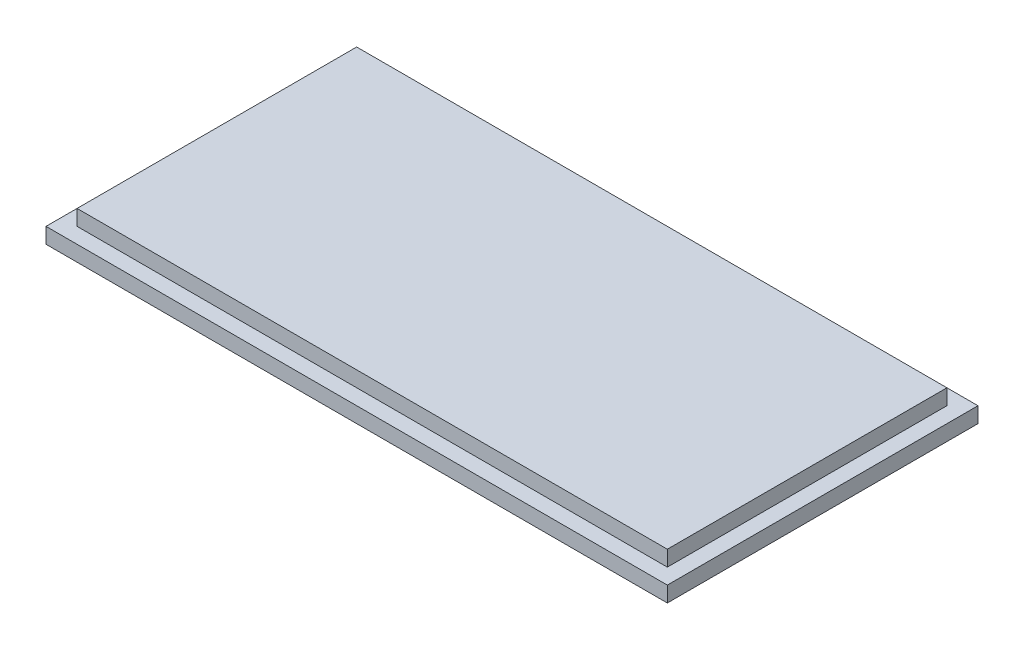
ISO-10303-21;
HEADER;
FILE_DESCRIPTION(('STEP AP214'),'2;1');
FILE_NAME('part.step','',(''),(''),'','','');
FILE_SCHEMA(('AUTOMOTIVE_DESIGN { 1 0 10303 214 1 1 1 1 }'));
ENDSEC;
DATA;
#1=APPLICATION_CONTEXT('core data for automotive mechanical design processes');
#2=APPLICATION_PROTOCOL_DEFINITION('international standard','automotive_design',2000,#1);
#3=PRODUCT_CONTEXT('',#1,'mechanical');
#4=PRODUCT('Part','Part','',(#3));
#5=PRODUCT_RELATED_PRODUCT_CATEGORY('part','',(#4));
#6=PRODUCT_DEFINITION_FORMATION('','',#4);
#7=PRODUCT_DEFINITION_CONTEXT('part definition',#1,'design');
#8=PRODUCT_DEFINITION('design','',#6,#7);
#9=PRODUCT_DEFINITION_SHAPE('','',#8);
#10=(LENGTH_UNIT() NAMED_UNIT(*) SI_UNIT(.MILLI.,.METRE.));
#11=(NAMED_UNIT(*) PLANE_ANGLE_UNIT() SI_UNIT($,.RADIAN.));
#12=(NAMED_UNIT(*) SI_UNIT($,.STERADIAN.) SOLID_ANGLE_UNIT());
#13=UNCERTAINTY_MEASURE_WITH_UNIT(LENGTH_MEASURE(1.E-05),#10,'distance_accuracy_value','');
#14=(GEOMETRIC_REPRESENTATION_CONTEXT(3) GLOBAL_UNCERTAINTY_ASSIGNED_CONTEXT((#13)) GLOBAL_UNIT_ASSIGNED_CONTEXT((#10,
#11,#12)) REPRESENTATION_CONTEXT('',''));
#15=CARTESIAN_POINT('',(0.,0.,0.));
#16=DIRECTION('',(0.,0.,1.));
#17=DIRECTION('',(1.,0.,0.));
#18=AXIS2_PLACEMENT_3D('',#15,#16,#17);
#19=CARTESIAN_POINT('',(0.,5.,0.));
#20=DIRECTION('',(0.,-1.,0.));
#21=DIRECTION('',(0.,0.,-1.));
#22=AXIS2_PLACEMENT_3D('',#19,#20,#21);
#23=PLANE('',#22);
#24=DIRECTION('',(0.,0.,1.));
#25=VECTOR('',#24,1.);
#26=CARTESIAN_POINT('',(0.,5.,0.));
#27=LINE('',#26,#25);
#28=CARTESIAN_POINT('',(0.,5.,-100.));
#29=VERTEX_POINT('',#28);
#30=CARTESIAN_POINT('',(0.,5.,0.));
#31=VERTEX_POINT('',#30);
#32=EDGE_CURVE('E139',#29,#31,#27,.T.);
#33=ORIENTED_EDGE('',*,*,#32,.T.);
#34=DIRECTION('',(1.,0.,0.));
#35=VECTOR('',#34,1.);
#36=CARTESIAN_POINT('',(0.,5.,0.));
#37=LINE('',#36,#35);
#38=CARTESIAN_POINT('',(200.,5.,0.));
#39=VERTEX_POINT('',#38);
#40=EDGE_CURVE('E143',#31,#39,#37,.T.);
#41=ORIENTED_EDGE('',*,*,#40,.T.);
#42=DIRECTION('',(0.,0.,-1.));
#43=VECTOR('',#42,1.);
#44=CARTESIAN_POINT('',(200.,5.,0.));
#45=LINE('',#44,#43);
#46=CARTESIAN_POINT('',(200.,5.,-100.));
#47=VERTEX_POINT('',#46);
#48=EDGE_CURVE('E147',#39,#47,#45,.T.);
#49=ORIENTED_EDGE('',*,*,#48,.T.);
#50=DIRECTION('',(-1.,0.,0.));
#51=VECTOR('',#50,1.);
#52=CARTESIAN_POINT('',(0.,5.,-100.));
#53=LINE('',#52,#51);
#54=EDGE_CURVE('E150',#47,#29,#53,.T.);
#55=ORIENTED_EDGE('',*,*,#54,.T.);
#56=EDGE_LOOP('',(#33,#41,#49,#55));
#57=FACE_BOUND('',#56,.T.);
#58=DIRECTION('',(0.,0.,-1.));
#59=VECTOR('',#58,1.);
#60=CARTESIAN_POINT('',(195.,5.,-95.));
#61=LINE('',#60,#59);
#62=CARTESIAN_POINT('',(195.,5.,-5.));
#63=VERTEX_POINT('',#62);
#64=CARTESIAN_POINT('',(195.,5.,-95.));
#65=VERTEX_POINT('',#64);
#66=EDGE_CURVE('E55',#63,#65,#61,.T.);
#67=ORIENTED_EDGE('',*,*,#66,.F.);
#68=DIRECTION('',(1.,0.,0.));
#69=VECTOR('',#68,1.);
#70=CARTESIAN_POINT('',(4.99999999999994,5.,-5.));
#71=LINE('',#70,#69);
#72=CARTESIAN_POINT('',(4.99999999999994,5.,-5.));
#73=VERTEX_POINT('',#72);
#74=EDGE_CURVE('E59',#73,#63,#71,.T.);
#75=ORIENTED_EDGE('',*,*,#74,.F.);
#76=DIRECTION('',(0.,0.,1.));
#77=VECTOR('',#76,1.);
#78=CARTESIAN_POINT('',(4.99999999999994,5.,-95.));
#79=LINE('',#78,#77);
#80=CARTESIAN_POINT('',(4.99999999999994,5.,-95.));
#81=VERTEX_POINT('',#80);
#82=EDGE_CURVE('E283',#81,#73,#79,.T.);
#83=ORIENTED_EDGE('',*,*,#82,.F.);
#84=DIRECTION('',(-1.,0.,0.));
#85=VECTOR('',#84,1.);
#86=CARTESIAN_POINT('',(4.99999999999994,5.,-95.));
#87=LINE('',#86,#85);
#88=EDGE_CURVE('E293',#65,#81,#87,.T.);
#89=ORIENTED_EDGE('',*,*,#88,.F.);
#90=EDGE_LOOP('',(#67,#75,#83,#89));
#91=FACE_BOUND('',#90,.T.);
#92=ADVANCED_FACE('F39',(#57,#91),#23,.F.);
#93=CARTESIAN_POINT('',(0.,5.,0.));
#94=DIRECTION('',(1.,0.,0.));
#95=DIRECTION('',(0.,0.,-1.));
#96=AXIS2_PLACEMENT_3D('',#93,#94,#95);
#97=PLANE('',#96);
#98=DIRECTION('',(0.,0.,1.));
#99=VECTOR('',#98,1.);
#100=CARTESIAN_POINT('',(0.,0.,0.));
#101=LINE('',#100,#99);
#102=CARTESIAN_POINT('',(0.,0.,-100.));
#103=VERTEX_POINT('',#102);
#104=CARTESIAN_POINT('',(0.,0.,0.));
#105=VERTEX_POINT('',#104);
#106=EDGE_CURVE('E128',#103,#105,#101,.T.);
#107=ORIENTED_EDGE('',*,*,#106,.T.);
#108=DIRECTION('',(0.,-1.,0.));
#109=VECTOR('',#108,1.);
#110=CARTESIAN_POINT('',(0.,5.,0.));
#111=LINE('',#110,#109);
#112=EDGE_CURVE('E11',#31,#105,#111,.T.);
#113=ORIENTED_EDGE('',*,*,#112,.F.);
#114=ORIENTED_EDGE('',*,*,#32,.F.);
#115=DIRECTION('',(0.,-1.,0.));
#116=VECTOR('',#115,1.);
#117=CARTESIAN_POINT('',(0.,5.,-100.));
#118=LINE('',#117,#116);
#119=EDGE_CURVE('E152',#29,#103,#118,.T.);
#120=ORIENTED_EDGE('',*,*,#119,.T.);
#121=EDGE_LOOP('',(#107,#113,#114,#120));
#122=FACE_BOUND('',#121,.T.);
#123=ADVANCED_FACE('F41',(#122),#97,.F.);
#124=CARTESIAN_POINT('',(0.,5.,0.));
#125=DIRECTION('',(0.,0.,-1.));
#126=DIRECTION('',(-1.,0.,0.));
#127=AXIS2_PLACEMENT_3D('',#124,#125,#126);
#128=PLANE('',#127);
#129=DIRECTION('',(1.,0.,0.));
#130=VECTOR('',#129,1.);
#131=CARTESIAN_POINT('',(0.,0.,0.));
#132=LINE('',#131,#130);
#133=CARTESIAN_POINT('',(200.,0.,0.));
#134=VERTEX_POINT('',#133);
#135=EDGE_CURVE('E133',#105,#134,#132,.T.);
#136=ORIENTED_EDGE('',*,*,#135,.T.);
#137=DIRECTION('',(0.,-1.,0.));
#138=VECTOR('',#137,1.);
#139=CARTESIAN_POINT('',(200.,5.,0.));
#140=LINE('',#139,#138);
#141=EDGE_CURVE('E48',#39,#134,#140,.T.);
#142=ORIENTED_EDGE('',*,*,#141,.F.);
#143=ORIENTED_EDGE('',*,*,#40,.F.);
#144=ORIENTED_EDGE('',*,*,#112,.T.);
#145=EDGE_LOOP('',(#136,#142,#143,#144));
#146=FACE_BOUND('',#145,.T.);
#147=ADVANCED_FACE('F188',(#146),#128,.F.);
#148=CARTESIAN_POINT('',(200.,5.,0.));
#149=DIRECTION('',(-1.,0.,0.));
#150=DIRECTION('',(0.,0.,1.));
#151=AXIS2_PLACEMENT_3D('',#148,#149,#150);
#152=PLANE('',#151);
#153=DIRECTION('',(0.,0.,-1.));
#154=VECTOR('',#153,1.);
#155=CARTESIAN_POINT('',(200.,0.,0.));
#156=LINE('',#155,#154);
#157=CARTESIAN_POINT('',(200.,0.,-100.));
#158=VERTEX_POINT('',#157);
#159=EDGE_CURVE('E156',#134,#158,#156,.T.);
#160=ORIENTED_EDGE('',*,*,#159,.T.);
#161=DIRECTION('',(0.,-1.,0.));
#162=VECTOR('',#161,1.);
#163=CARTESIAN_POINT('',(200.,5.,-100.));
#164=LINE('',#163,#162);
#165=EDGE_CURVE('E164',#47,#158,#164,.T.);
#166=ORIENTED_EDGE('',*,*,#165,.F.);
#167=ORIENTED_EDGE('',*,*,#48,.F.);
#168=ORIENTED_EDGE('',*,*,#141,.T.);
#169=EDGE_LOOP('',(#160,#166,#167,#168));
#170=FACE_BOUND('',#169,.T.);
#171=ADVANCED_FACE('F173',(#170),#152,.F.);
#172=CARTESIAN_POINT('',(0.,5.,-100.));
#173=DIRECTION('',(0.,0.,1.));
#174=DIRECTION('',(1.,0.,0.));
#175=AXIS2_PLACEMENT_3D('',#172,#173,#174);
#176=PLANE('',#175);
#177=DIRECTION('',(-1.,0.,0.));
#178=VECTOR('',#177,1.);
#179=CARTESIAN_POINT('',(0.,0.,-100.));
#180=LINE('',#179,#178);
#181=EDGE_CURVE('E144',#158,#103,#180,.T.);
#182=ORIENTED_EDGE('',*,*,#181,.T.);
#183=ORIENTED_EDGE('',*,*,#119,.F.);
#184=ORIENTED_EDGE('',*,*,#54,.F.);
#185=ORIENTED_EDGE('',*,*,#165,.T.);
#186=EDGE_LOOP('',(#182,#183,#184,#185));
#187=FACE_BOUND('',#186,.T.);
#188=ADVANCED_FACE('F182',(#187),#176,.F.);
#189=CARTESIAN_POINT('',(0.,0.,0.));
#190=DIRECTION('',(0.,-1.,0.));
#191=DIRECTION('',(0.,0.,-1.));
#192=AXIS2_PLACEMENT_3D('',#189,#190,#191);
#193=PLANE('',#192);
#194=ORIENTED_EDGE('',*,*,#106,.F.);
#195=ORIENTED_EDGE('',*,*,#181,.F.);
#196=ORIENTED_EDGE('',*,*,#159,.F.);
#197=ORIENTED_EDGE('',*,*,#135,.F.);
#198=EDGE_LOOP('',(#194,#195,#196,#197));
#199=FACE_BOUND('',#198,.T.);
#200=ADVANCED_FACE('F179',(#199),#193,.T.);
#201=CARTESIAN_POINT('',(195.,10.,-95.));
#202=DIRECTION('',(-1.,0.,0.));
#203=DIRECTION('',(0.,0.,1.));
#204=AXIS2_PLACEMENT_3D('',#201,#202,#203);
#205=PLANE('',#204);
#206=ORIENTED_EDGE('',*,*,#66,.T.);
#207=DIRECTION('',(0.,-1.,0.));
#208=VECTOR('',#207,1.);
#209=CARTESIAN_POINT('',(195.,10.,-95.));
#210=LINE('',#209,#208);
#211=CARTESIAN_POINT('',(195.,10.,-95.));
#212=VERTEX_POINT('',#211);
#213=EDGE_CURVE('E108',#212,#65,#210,.T.);
#214=ORIENTED_EDGE('',*,*,#213,.F.);
#215=DIRECTION('',(0.,0.,-1.));
#216=VECTOR('',#215,1.);
#217=CARTESIAN_POINT('',(195.,10.,-95.));
#218=LINE('',#217,#216);
#219=CARTESIAN_POINT('',(195.,10.,-5.));
#220=VERTEX_POINT('',#219);
#221=EDGE_CURVE('E115',#220,#212,#218,.T.);
#222=ORIENTED_EDGE('',*,*,#221,.F.);
#223=DIRECTION('',(0.,-1.,0.));
#224=VECTOR('',#223,1.);
#225=CARTESIAN_POINT('',(195.,10.,-5.));
#226=LINE('',#225,#224);
#227=EDGE_CURVE('E280',#220,#63,#226,.T.);
#228=ORIENTED_EDGE('',*,*,#227,.T.);
#229=EDGE_LOOP('',(#206,#214,#222,#228));
#230=FACE_BOUND('',#229,.T.);
#231=ADVANCED_FACE('F126',(#230),#205,.F.);
#232=CARTESIAN_POINT('',(4.99999999999994,10.,-95.));
#233=DIRECTION('',(0.,0.,1.));
#234=DIRECTION('',(1.,0.,0.));
#235=AXIS2_PLACEMENT_3D('',#232,#233,#234);
#236=PLANE('',#235);
#237=ORIENTED_EDGE('',*,*,#88,.T.);
#238=DIRECTION('',(0.,-1.,0.));
#239=VECTOR('',#238,1.);
#240=CARTESIAN_POINT('',(4.99999999999994,10.,-95.));
#241=LINE('',#240,#239);
#242=CARTESIAN_POINT('',(4.99999999999994,10.,-95.));
#243=VERTEX_POINT('',#242);
#244=EDGE_CURVE('E110',#243,#81,#241,.T.);
#245=ORIENTED_EDGE('',*,*,#244,.F.);
#246=DIRECTION('',(-1.,0.,0.));
#247=VECTOR('',#246,1.);
#248=CARTESIAN_POINT('',(4.99999999999994,10.,-95.));
#249=LINE('',#248,#247);
#250=EDGE_CURVE('E103',#212,#243,#249,.T.);
#251=ORIENTED_EDGE('',*,*,#250,.F.);
#252=ORIENTED_EDGE('',*,*,#213,.T.);
#253=EDGE_LOOP('',(#237,#245,#251,#252));
#254=FACE_BOUND('',#253,.T.);
#255=ADVANCED_FACE('F106',(#254),#236,.F.);
#256=CARTESIAN_POINT('',(4.99999999999994,10.,-95.));
#257=DIRECTION('',(1.,0.,0.));
#258=DIRECTION('',(0.,0.,-1.));
#259=AXIS2_PLACEMENT_3D('',#256,#257,#258);
#260=PLANE('',#259);
#261=ORIENTED_EDGE('',*,*,#82,.T.);
#262=DIRECTION('',(0.,-1.,0.));
#263=VECTOR('',#262,1.);
#264=CARTESIAN_POINT('',(4.99999999999994,10.,-5.));
#265=LINE('',#264,#263);
#266=CARTESIAN_POINT('',(4.99999999999994,10.,-5.));
#267=VERTEX_POINT('',#266);
#268=EDGE_CURVE('E135',#267,#73,#265,.T.);
#269=ORIENTED_EDGE('',*,*,#268,.F.);
#270=DIRECTION('',(0.,0.,1.));
#271=VECTOR('',#270,1.);
#272=CARTESIAN_POINT('',(4.99999999999994,10.,-95.));
#273=LINE('',#272,#271);
#274=EDGE_CURVE('E114',#243,#267,#273,.T.);
#275=ORIENTED_EDGE('',*,*,#274,.F.);
#276=ORIENTED_EDGE('',*,*,#244,.T.);
#277=EDGE_LOOP('',(#261,#269,#275,#276));
#278=FACE_BOUND('',#277,.T.);
#279=ADVANCED_FACE('F224',(#278),#260,.F.);
#280=CARTESIAN_POINT('',(4.99999999999994,10.,-5.));
#281=DIRECTION('',(0.,0.,-1.));
#282=DIRECTION('',(-1.,0.,0.));
#283=AXIS2_PLACEMENT_3D('',#280,#281,#282);
#284=PLANE('',#283);
#285=ORIENTED_EDGE('',*,*,#74,.T.);
#286=ORIENTED_EDGE('',*,*,#227,.F.);
#287=DIRECTION('',(1.,0.,0.));
#288=VECTOR('',#287,1.);
#289=CARTESIAN_POINT('',(4.99999999999994,10.,-5.));
#290=LINE('',#289,#288);
#291=EDGE_CURVE('E120',#267,#220,#290,.T.);
#292=ORIENTED_EDGE('',*,*,#291,.F.);
#293=ORIENTED_EDGE('',*,*,#268,.T.);
#294=EDGE_LOOP('',(#285,#286,#292,#293));
#295=FACE_BOUND('',#294,.T.);
#296=ADVANCED_FACE('F230',(#295),#284,.F.);
#297=CARTESIAN_POINT('',(0.,10.,0.));
#298=DIRECTION('',(0.,1.,0.));
#299=DIRECTION('',(0.,0.,1.));
#300=AXIS2_PLACEMENT_3D('',#297,#298,#299);
#301=PLANE('',#300);
#302=ORIENTED_EDGE('',*,*,#221,.T.);
#303=ORIENTED_EDGE('',*,*,#250,.T.);
#304=ORIENTED_EDGE('',*,*,#274,.T.);
#305=ORIENTED_EDGE('',*,*,#291,.T.);
#306=EDGE_LOOP('',(#302,#303,#304,#305));
#307=FACE_BOUND('',#306,.T.);
#308=ADVANCED_FACE('F118',(#307),#301,.T.);
#309=CLOSED_SHELL('',(#92,#123,#147,#171,#188,#200,#231,#255,#279,#296,#308));
#310=MANIFOLD_SOLID_BREP('B2',#309);
#311=ADVANCED_BREP_SHAPE_REPRESENTATION('',(#18,#310),#14);
#312=SHAPE_DEFINITION_REPRESENTATION(#9,#311);
ENDSEC;
END-ISO-10303-21;
